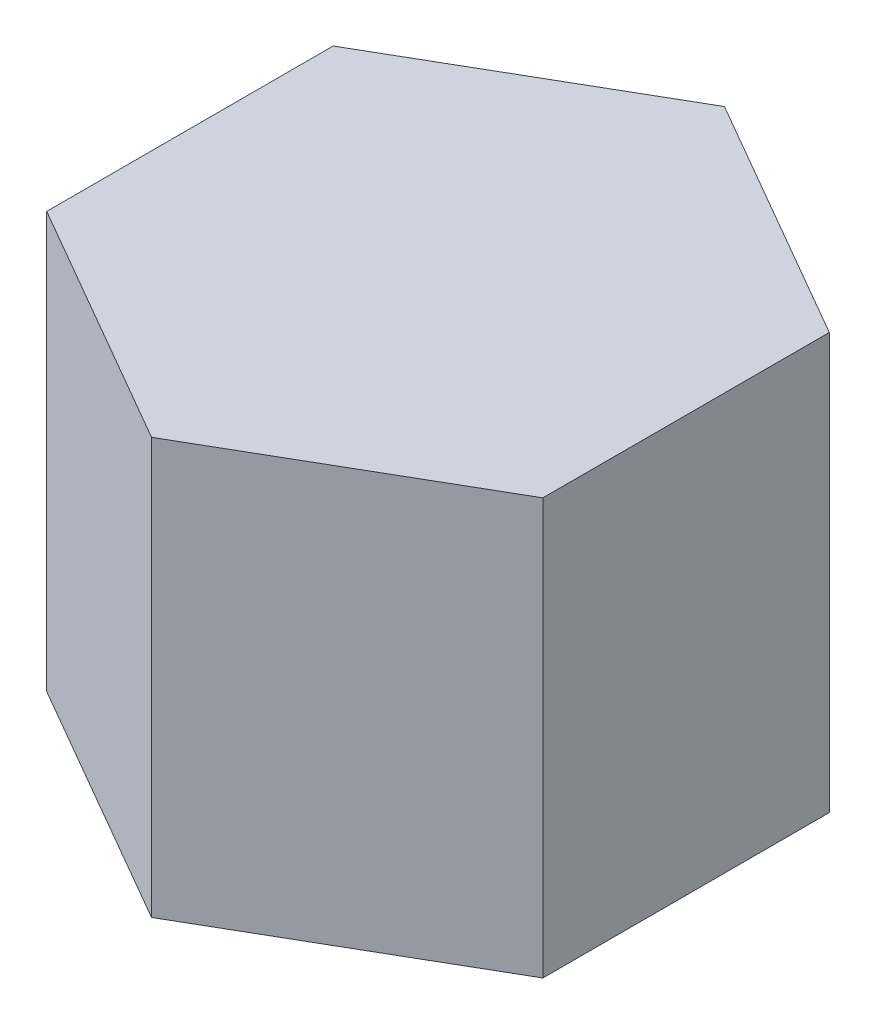
ISO-10303-21;
HEADER;
FILE_DESCRIPTION(('STEP AP214'),'2;1');
FILE_NAME('part.step','',(''),(''),'','','');
FILE_SCHEMA(('AUTOMOTIVE_DESIGN { 1 0 10303 214 1 1 1 1 }'));
ENDSEC;
DATA;
#1=APPLICATION_CONTEXT('core data for automotive mechanical design processes');
#2=APPLICATION_PROTOCOL_DEFINITION('international standard','automotive_design',2000,#1);
#3=PRODUCT_CONTEXT('',#1,'mechanical');
#4=PRODUCT('Part','Part','',(#3));
#5=PRODUCT_RELATED_PRODUCT_CATEGORY('part','',(#4));
#6=PRODUCT_DEFINITION_FORMATION('','',#4);
#7=PRODUCT_DEFINITION_CONTEXT('part definition',#1,'design');
#8=PRODUCT_DEFINITION('design','',#6,#7);
#9=PRODUCT_DEFINITION_SHAPE('','',#8);
#10=(LENGTH_UNIT() NAMED_UNIT(*) SI_UNIT(.MILLI.,.METRE.));
#11=(NAMED_UNIT(*) PLANE_ANGLE_UNIT() SI_UNIT($,.RADIAN.));
#12=(NAMED_UNIT(*) SI_UNIT($,.STERADIAN.) SOLID_ANGLE_UNIT());
#13=UNCERTAINTY_MEASURE_WITH_UNIT(LENGTH_MEASURE(1.E-05),#10,'distance_accuracy_value','');
#14=(GEOMETRIC_REPRESENTATION_CONTEXT(3) GLOBAL_UNCERTAINTY_ASSIGNED_CONTEXT((#13)) GLOBAL_UNIT_ASSIGNED_CONTEXT((#10,
#11,#12)) REPRESENTATION_CONTEXT('',''));
#15=CARTESIAN_POINT('',(0.,0.,0.));
#16=DIRECTION('',(0.,0.,1.));
#17=DIRECTION('',(1.,0.,0.));
#18=AXIS2_PLACEMENT_3D('',#15,#16,#17);
#19=CARTESIAN_POINT('',(202.642660308706,-148.537700895744,289.774920412926));
#20=DIRECTION('',(-0.499999999999943,0.,-0.866025403784472));
#21=DIRECTION('',(-0.866025403784472,0.,0.499999999999943));
#22=AXIS2_PLACEMENT_3D('',#19,#20,#21);
#23=PLANE('',#22);
#24=CARTESIAN_POINT('',(202.339551417382,-149.045793579175,289.949920412926));
#25=DIRECTION('',(0.866025403784471,0.,-0.499999999999943));
#26=VECTOR('',#25,1.);
#27=LINE('',#24,#26);
#28=CARTESIAN_POINT('',(202.339551417382,-149.045793579175,289.949920412926));
#29=VERTEX_POINT('',#28);
#30=CARTESIAN_POINT('',(202.642660308706,-149.045793579175,289.774920412926));
#31=VERTEX_POINT('',#30);
#32=EDGE_CURVE('E170',#29,#31,#27,.T.);
#33=ORIENTED_EDGE('',*,*,#32,.T.);
#34=CARTESIAN_POINT('',(202.642660308706,-148.537700895744,289.774920412926));
#35=DIRECTION('',(0.,-1.,0.));
#36=VECTOR('',#35,1.);
#37=LINE('',#34,#36);
#38=CARTESIAN_POINT('',(202.642660308706,-148.537700895744,289.774920412926));
#39=VERTEX_POINT('',#38);
#40=EDGE_CURVE('E35',#39,#31,#37,.T.);
#41=ORIENTED_EDGE('',*,*,#40,.F.);
#42=CARTESIAN_POINT('',(202.339551417382,-148.537700895744,289.949920412926));
#43=DIRECTION('',(0.866025403784471,0.,-0.499999999999943));
#44=VECTOR('',#43,1.);
#45=LINE('',#42,#44);
#46=CARTESIAN_POINT('',(202.339551417382,-148.537700895744,289.949920412926));
#47=VERTEX_POINT('',#46);
#48=EDGE_CURVE('E159',#47,#39,#45,.T.);
#49=ORIENTED_EDGE('',*,*,#48,.F.);
#50=CARTESIAN_POINT('',(202.339551417382,-148.537700895744,289.949920412926));
#51=DIRECTION('',(0.,-1.,0.));
#52=VECTOR('',#51,1.);
#53=LINE('',#50,#52);
#54=EDGE_CURVE('E10',#47,#29,#53,.T.);
#55=ORIENTED_EDGE('',*,*,#54,.T.);
#56=EDGE_LOOP('',(#33,#41,#49,#55));
#57=FACE_BOUND('',#56,.T.);
#58=ADVANCED_FACE('F16',(#57),#23,.F.);
#59=CARTESIAN_POINT('',(202.339551417382,-148.537700895744,289.949920412926));
#60=DIRECTION('',(0.500000000000062,0.,-0.866025403784403));
#61=DIRECTION('',(-0.866025403784403,0.,-0.500000000000062));
#62=AXIS2_PLACEMENT_3D('',#59,#60,#61);
#63=PLANE('',#62);
#64=CARTESIAN_POINT('',(202.036442526057,-149.045793579175,289.774920412925));
#65=DIRECTION('',(0.866025403784403,0.,0.500000000000062));
#66=VECTOR('',#65,1.);
#67=LINE('',#64,#66);
#68=CARTESIAN_POINT('',(202.036442526057,-149.045793579175,289.774920412925));
#69=VERTEX_POINT('',#68);
#70=EDGE_CURVE('E167',#69,#29,#67,.T.);
#71=ORIENTED_EDGE('',*,*,#70,.T.);
#72=ORIENTED_EDGE('',*,*,#54,.F.);
#73=CARTESIAN_POINT('',(202.036442526057,-148.537700895744,289.774920412925));
#74=DIRECTION('',(0.866025403784403,0.,0.500000000000062));
#75=VECTOR('',#74,1.);
#76=LINE('',#73,#75);
#77=CARTESIAN_POINT('',(202.036442526057,-148.537700895744,289.774920412925));
#78=VERTEX_POINT('',#77);
#79=EDGE_CURVE('E156',#78,#47,#76,.T.);
#80=ORIENTED_EDGE('',*,*,#79,.F.);
#81=CARTESIAN_POINT('',(202.036442526057,-148.537700895744,289.774920412925));
#82=DIRECTION('',(0.,-1.,0.));
#83=VECTOR('',#82,1.);
#84=LINE('',#81,#83);
#85=EDGE_CURVE('E27',#78,#69,#84,.T.);
#86=ORIENTED_EDGE('',*,*,#85,.T.);
#87=EDGE_LOOP('',(#71,#72,#80,#86));
#88=FACE_BOUND('',#87,.T.);
#89=ADVANCED_FACE('F189',(#88),#63,.F.);
#90=CARTESIAN_POINT('',(202.036442526057,-148.537700895744,290.831971220494));
#91=DIRECTION('',(1.,0.,0.));
#92=DIRECTION('',(0.,1.,0.));
#93=AXIS2_PLACEMENT_3D('',#90,#91,#92);
#94=PLANE('',#93);
#95=CARTESIAN_POINT('',(202.036442526057,-149.045793579175,289.424920412926));
#96=DIRECTION('',(0.,0.,1.));
#97=VECTOR('',#96,1.);
#98=LINE('',#95,#97);
#99=CARTESIAN_POINT('',(202.036442526057,-149.045793579175,289.424920412926));
#100=VERTEX_POINT('',#99);
#101=EDGE_CURVE('E163',#100,#69,#98,.T.);
#102=ORIENTED_EDGE('',*,*,#101,.T.);
#103=ORIENTED_EDGE('',*,*,#85,.F.);
#104=CARTESIAN_POINT('',(202.036442526057,-148.537700895744,289.424920412926));
#105=DIRECTION('',(0.,0.,1.));
#106=VECTOR('',#105,1.);
#107=LINE('',#104,#106);
#108=CARTESIAN_POINT('',(202.036442526057,-148.537700895744,289.424920412926));
#109=VERTEX_POINT('',#108);
#110=EDGE_CURVE('E106',#109,#78,#107,.T.);
#111=ORIENTED_EDGE('',*,*,#110,.F.);
#112=CARTESIAN_POINT('',(202.036442526057,-148.537700895744,289.424920412926));
#113=DIRECTION('',(0.,-1.,0.));
#114=VECTOR('',#113,1.);
#115=LINE('',#112,#114);
#116=EDGE_CURVE('E94',#109,#100,#115,.T.);
#117=ORIENTED_EDGE('',*,*,#116,.T.);
#118=EDGE_LOOP('',(#102,#103,#111,#117));
#119=FACE_BOUND('',#118,.T.);
#120=ADVANCED_FACE('F198',(#119),#94,.F.);
#121=CARTESIAN_POINT('',(202.036442526057,-148.537700895744,289.424920412926));
#122=DIRECTION('',(0.499999999999978,0.,0.866025403784452));
#123=DIRECTION('',(0.866025403784452,0.,-0.499999999999978));
#124=AXIS2_PLACEMENT_3D('',#121,#122,#123);
#125=PLANE('',#124);
#126=CARTESIAN_POINT('',(202.339551417382,-149.045793579175,289.249920412926));
#127=DIRECTION('',(-0.866025403784452,0.,0.499999999999978));
#128=VECTOR('',#127,1.);
#129=LINE('',#126,#128);
#130=CARTESIAN_POINT('',(202.339551417382,-149.045793579175,289.249920412926));
#131=VERTEX_POINT('',#130);
#132=EDGE_CURVE('E162',#131,#100,#129,.T.);
#133=ORIENTED_EDGE('',*,*,#132,.T.);
#134=ORIENTED_EDGE('',*,*,#116,.F.);
#135=CARTESIAN_POINT('',(202.339551417382,-148.537700895744,289.249920412926));
#136=DIRECTION('',(-0.866025403784452,0.,0.499999999999978));
#137=VECTOR('',#136,1.);
#138=LINE('',#135,#137);
#139=CARTESIAN_POINT('',(202.339551417382,-148.537700895744,289.249920412926));
#140=VERTEX_POINT('',#139);
#141=EDGE_CURVE('E98',#140,#109,#138,.T.);
#142=ORIENTED_EDGE('',*,*,#141,.F.);
#143=CARTESIAN_POINT('',(202.339551417382,-148.537700895744,289.249920412926));
#144=DIRECTION('',(0.,-1.,0.));
#145=VECTOR('',#144,1.);
#146=LINE('',#143,#145);
#147=EDGE_CURVE('E79',#140,#131,#146,.T.);
#148=ORIENTED_EDGE('',*,*,#147,.T.);
#149=EDGE_LOOP('',(#133,#134,#142,#148));
#150=FACE_BOUND('',#149,.T.);
#151=ADVANCED_FACE('F100',(#150),#125,.F.);
#152=CARTESIAN_POINT('',(202.339551417382,-148.537700895744,289.249920412926));
#153=DIRECTION('',(-0.499999999999978,0.,0.866025403784452));
#154=DIRECTION('',(0.866025403784452,0.,0.499999999999978));
#155=AXIS2_PLACEMENT_3D('',#152,#153,#154);
#156=PLANE('',#155);
#157=CARTESIAN_POINT('',(202.642660308706,-149.045793579175,289.424920412926));
#158=DIRECTION('',(-0.866025403784452,0.,-0.499999999999978));
#159=VECTOR('',#158,1.);
#160=LINE('',#157,#159);
#161=CARTESIAN_POINT('',(202.642660308706,-149.045793579175,289.424920412926));
#162=VERTEX_POINT('',#161);
#163=EDGE_CURVE('E88',#162,#131,#160,.T.);
#164=ORIENTED_EDGE('',*,*,#163,.T.);
#165=ORIENTED_EDGE('',*,*,#147,.F.);
#166=CARTESIAN_POINT('',(202.642660308706,-148.537700895744,289.424920412926));
#167=DIRECTION('',(-0.866025403784452,0.,-0.499999999999978));
#168=VECTOR('',#167,1.);
#169=LINE('',#166,#168);
#170=CARTESIAN_POINT('',(202.642660308706,-148.537700895744,289.424920412926));
#171=VERTEX_POINT('',#170);
#172=EDGE_CURVE('E84',#171,#140,#169,.T.);
#173=ORIENTED_EDGE('',*,*,#172,.F.);
#174=CARTESIAN_POINT('',(202.642660308706,-148.537700895744,289.424920412926));
#175=DIRECTION('',(0.,-1.,0.));
#176=VECTOR('',#175,1.);
#177=LINE('',#174,#176);
#178=EDGE_CURVE('E58',#171,#162,#177,.T.);
#179=ORIENTED_EDGE('',*,*,#178,.T.);
#180=EDGE_LOOP('',(#164,#165,#173,#179));
#181=FACE_BOUND('',#180,.T.);
#182=ADVANCED_FACE('F82',(#181),#156,.F.);
#183=CARTESIAN_POINT('',(202.642660308706,-148.537700895744,290.831971220494));
#184=DIRECTION('',(-1.,0.,0.));
#185=DIRECTION('',(0.,-1.,0.));
#186=AXIS2_PLACEMENT_3D('',#183,#184,#185);
#187=PLANE('',#186);
#188=CARTESIAN_POINT('',(202.642660308706,-149.045793579175,289.774920412926));
#189=DIRECTION('',(0.,0.,-1.));
#190=VECTOR('',#189,1.);
#191=LINE('',#188,#190);
#192=EDGE_CURVE('E160',#31,#162,#191,.T.);
#193=ORIENTED_EDGE('',*,*,#192,.T.);
#194=ORIENTED_EDGE('',*,*,#178,.F.);
#195=CARTESIAN_POINT('',(202.642660308706,-148.537700895744,289.774920412926));
#196=DIRECTION('',(0.,0.,-1.));
#197=VECTOR('',#196,1.);
#198=LINE('',#195,#197);
#199=EDGE_CURVE('E112',#39,#171,#198,.T.);
#200=ORIENTED_EDGE('',*,*,#199,.F.);
#201=ORIENTED_EDGE('',*,*,#40,.T.);
#202=EDGE_LOOP('',(#193,#194,#200,#201));
#203=FACE_BOUND('',#202,.T.);
#204=ADVANCED_FACE('F131',(#203),#187,.F.);
#205=CARTESIAN_POINT('',(206.339551417382,-148.537700895744,290.831971220494));
#206=DIRECTION('',(0.,-1.,0.));
#207=DIRECTION('',(1.,0.,0.));
#208=AXIS2_PLACEMENT_3D('',#205,#206,#207);
#209=PLANE('',#208);
#210=ORIENTED_EDGE('',*,*,#48,.T.);
#211=ORIENTED_EDGE('',*,*,#199,.T.);
#212=ORIENTED_EDGE('',*,*,#172,.T.);
#213=ORIENTED_EDGE('',*,*,#141,.T.);
#214=ORIENTED_EDGE('',*,*,#110,.T.);
#215=ORIENTED_EDGE('',*,*,#79,.T.);
#216=EDGE_LOOP('',(#210,#211,#212,#213,#214,#215));
#217=FACE_BOUND('',#216,.T.);
#218=ADVANCED_FACE('F111',(#217),#209,.F.);
#219=CARTESIAN_POINT('',(206.339551417382,-149.045793579175,290.831971220494));
#220=DIRECTION('',(0.,-1.,0.));
#221=DIRECTION('',(1.,0.,0.));
#222=AXIS2_PLACEMENT_3D('',#219,#220,#221);
#223=PLANE('',#222);
#224=ORIENTED_EDGE('',*,*,#32,.F.);
#225=ORIENTED_EDGE('',*,*,#70,.F.);
#226=ORIENTED_EDGE('',*,*,#101,.F.);
#227=ORIENTED_EDGE('',*,*,#132,.F.);
#228=ORIENTED_EDGE('',*,*,#163,.F.);
#229=ORIENTED_EDGE('',*,*,#192,.F.);
#230=EDGE_LOOP('',(#224,#225,#226,#227,#228,#229));
#231=FACE_BOUND('',#230,.T.);
#232=ADVANCED_FACE('F130',(#231),#223,.T.);
#233=CLOSED_SHELL('',(#58,#89,#120,#151,#182,#204,#218,#232));
#234=MANIFOLD_SOLID_BREP('B1',#233);
#235=ADVANCED_BREP_SHAPE_REPRESENTATION('',(#18,#234),#14);
#236=SHAPE_DEFINITION_REPRESENTATION(#9,#235);
ENDSEC;
END-ISO-10303-21;
